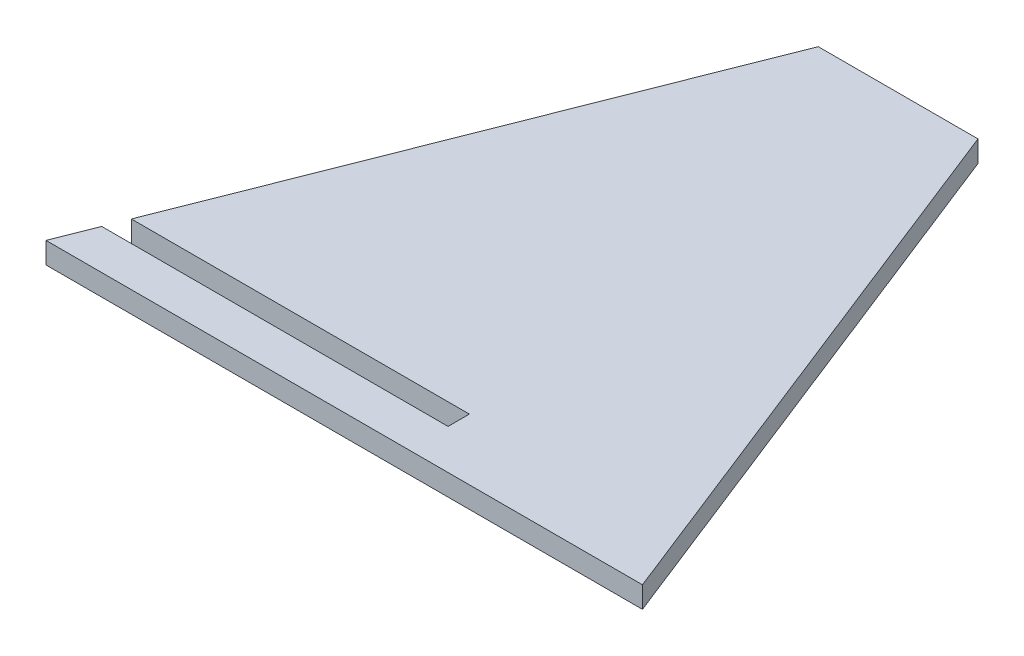
ISO-10303-21;
HEADER;
FILE_DESCRIPTION(('STEP AP214'),'2;1');
FILE_NAME('part.step','',(''),(''),'','','');
FILE_SCHEMA(('AUTOMOTIVE_DESIGN { 1 0 10303 214 1 1 1 1 }'));
ENDSEC;
DATA;
#1=APPLICATION_CONTEXT('core data for automotive mechanical design processes');
#2=APPLICATION_PROTOCOL_DEFINITION('international standard','automotive_design',2000,#1);
#3=PRODUCT_CONTEXT('',#1,'mechanical');
#4=PRODUCT('Part','Part','',(#3));
#5=PRODUCT_RELATED_PRODUCT_CATEGORY('part','',(#4));
#6=PRODUCT_DEFINITION_FORMATION('','',#4);
#7=PRODUCT_DEFINITION_CONTEXT('part definition',#1,'design');
#8=PRODUCT_DEFINITION('design','',#6,#7);
#9=PRODUCT_DEFINITION_SHAPE('','',#8);
#10=(LENGTH_UNIT() NAMED_UNIT(*) SI_UNIT(.MILLI.,.METRE.));
#11=(NAMED_UNIT(*) PLANE_ANGLE_UNIT() SI_UNIT($,.RADIAN.));
#12=(NAMED_UNIT(*) SI_UNIT($,.STERADIAN.) SOLID_ANGLE_UNIT());
#13=UNCERTAINTY_MEASURE_WITH_UNIT(LENGTH_MEASURE(1.E-05),#10,'distance_accuracy_value','');
#14=(GEOMETRIC_REPRESENTATION_CONTEXT(3) GLOBAL_UNCERTAINTY_ASSIGNED_CONTEXT((#13)) GLOBAL_UNIT_ASSIGNED_CONTEXT((#10,
#11,#12)) REPRESENTATION_CONTEXT('',''));
#15=CARTESIAN_POINT('',(0.,0.,0.));
#16=DIRECTION('',(0.,0.,1.));
#17=DIRECTION('',(1.,0.,0.));
#18=AXIS2_PLACEMENT_3D('',#15,#16,#17);
#19=CARTESIAN_POINT('',(-70.9901652571003,4.,0.));
#20=DIRECTION('',(0.930345938397084,0.,0.366683016934312));
#21=DIRECTION('',(0.366683016934313,0.,-0.930345938397083));
#22=AXIS2_PLACEMENT_3D('',#19,#20,#21);
#23=PLANE('',#22);
#24=DIRECTION('',(0.,-1.,0.));
#25=VECTOR('',#24,1.);
#26=CARTESIAN_POINT('',(-66.4575989065557,4.,-11.5000000000001));
#27=LINE('',#26,#25);
#28=CARTESIAN_POINT('',(-66.4575989065557,4.,-11.5000000000001));
#29=VERTEX_POINT('',#28);
#30=CARTESIAN_POINT('',(-66.4575989065557,0.,-11.5000000000001));
#31=VERTEX_POINT('',#30);
#32=EDGE_CURVE('E162',#29,#31,#27,.T.);
#33=ORIENTED_EDGE('',*,*,#32,.F.);
#34=DIRECTION('',(-0.366683016934313,0.,0.930345938397083));
#35=VECTOR('',#34,1.);
#36=CARTESIAN_POINT('',(-70.9901652571003,4.,0.));
#37=LINE('',#36,#35);
#38=CARTESIAN_POINT('',(-30.,4.,-104.));
#39=VERTEX_POINT('',#38);
#40=EDGE_CURVE('E155',#39,#29,#37,.T.);
#41=ORIENTED_EDGE('',*,*,#40,.F.);
#42=DIRECTION('',(0.,-1.,0.));
#43=VECTOR('',#42,1.);
#44=CARTESIAN_POINT('',(-30.,4.,-104.));
#45=LINE('',#44,#43);
#46=CARTESIAN_POINT('',(-30.,0.,-104.));
#47=VERTEX_POINT('',#46);
#48=EDGE_CURVE('E134',#39,#47,#45,.T.);
#49=ORIENTED_EDGE('',*,*,#48,.T.);
#50=DIRECTION('',(-0.366683016934313,0.,0.930345938397083));
#51=VECTOR('',#50,1.);
#52=CARTESIAN_POINT('',(-70.9901652571003,0.,0.));
#53=LINE('',#52,#51);
#54=EDGE_CURVE('E145',#47,#31,#53,.T.);
#55=ORIENTED_EDGE('',*,*,#54,.T.);
#56=EDGE_LOOP('',(#33,#41,#49,#55));
#57=FACE_BOUND('',#56,.T.);
#58=ADVANCED_FACE('F38',(#57),#23,.F.);
#59=CARTESIAN_POINT('',(0.,4.00000000000001,0.));
#60=DIRECTION('',(0.,-1.,0.));
#61=DIRECTION('',(0.,0.,-0.999999999999999));
#62=AXIS2_PLACEMENT_3D('',#59,#60,#61);
#63=PLANE('',#62);
#64=DIRECTION('',(-1.,0.,0.));
#65=VECTOR('',#64,1.);
#66=CARTESIAN_POINT('',(0.,4.00000000000001,-11.5000000000001));
#67=LINE('',#66,#65);
#68=CARTESIAN_POINT('',(-3.00000000000011,4.00000000000001,-11.5000000000001));
#69=VERTEX_POINT('',#68);
#70=EDGE_CURVE('E153',#69,#29,#67,.T.);
#71=ORIENTED_EDGE('',*,*,#70,.F.);
#72=DIRECTION('',(0.,0.,0.999999999999999));
#73=VECTOR('',#72,1.);
#74=CARTESIAN_POINT('',(-3.00000000000011,4.00000000000001,0.));
#75=LINE('',#74,#73);
#76=CARTESIAN_POINT('',(-3.00000000000011,4.00000000000001,-7.50000000000006));
#77=VERTEX_POINT('',#76);
#78=EDGE_CURVE('E130',#69,#77,#75,.T.);
#79=ORIENTED_EDGE('',*,*,#78,.T.);
#80=DIRECTION('',(-1.,0.,0.));
#81=VECTOR('',#80,1.);
#82=CARTESIAN_POINT('',(0.,4.00000000000001,-7.50000000000006));
#83=LINE('',#82,#81);
#84=CARTESIAN_POINT('',(-68.0341437241365,4.,-7.50000000000006));
#85=VERTEX_POINT('',#84);
#86=EDGE_CURVE('E117',#77,#85,#83,.T.);
#87=ORIENTED_EDGE('',*,*,#86,.T.);
#88=CARTESIAN_POINT('',(-70.9901652571003,4.,0.));
#89=VERTEX_POINT('',#88);
#90=EDGE_CURVE('E158',#85,#89,#37,.T.);
#91=ORIENTED_EDGE('',*,*,#90,.T.);
#92=DIRECTION('',(1.,0.,0.));
#93=VECTOR('',#92,1.);
#94=CARTESIAN_POINT('',(40.9999999999999,4.00000000000002,0.));
#95=LINE('',#94,#93);
#96=CARTESIAN_POINT('',(40.9999999999999,4.00000000000002,0.));
#97=VERTEX_POINT('',#96);
#98=EDGE_CURVE('E55',#89,#97,#95,.T.);
#99=ORIENTED_EDGE('',*,*,#98,.T.);
#100=DIRECTION('',(-0.366759162050394,0.,-0.93031592324978));
#101=VECTOR('',#100,1.);
#102=CARTESIAN_POINT('',(-2.22044604925031E-13,4.00000000000001,-104.));
#103=LINE('',#102,#101);
#104=CARTESIAN_POINT('',(-2.22044604925031E-13,4.00000000000001,-104.));
#105=VERTEX_POINT('',#104);
#106=EDGE_CURVE('E144',#97,#105,#103,.T.);
#107=ORIENTED_EDGE('',*,*,#106,.T.);
#108=DIRECTION('',(-1.,0.,0.));
#109=VECTOR('',#108,1.);
#110=CARTESIAN_POINT('',(-30.,4.,-104.));
#111=LINE('',#110,#109);
#112=EDGE_CURVE('E87',#105,#39,#111,.T.);
#113=ORIENTED_EDGE('',*,*,#112,.T.);
#114=ORIENTED_EDGE('',*,*,#40,.T.);
#115=EDGE_LOOP('',(#71,#79,#87,#91,#99,#107,#113,#114));
#116=FACE_BOUND('',#115,.T.);
#117=ADVANCED_FACE('F182',(#116),#63,.F.);
#118=CARTESIAN_POINT('',(0.,0.,0.));
#119=DIRECTION('',(0.,-1.,0.));
#120=DIRECTION('',(0.,0.,-0.999999999999999));
#121=AXIS2_PLACEMENT_3D('',#118,#119,#120);
#122=PLANE('',#121);
#123=DIRECTION('',(0.,0.,0.999999999999999));
#124=VECTOR('',#123,1.);
#125=CARTESIAN_POINT('',(-3.00000000000011,-2.77555756156289E-13,-11.5000000000001));
#126=LINE('',#125,#124);
#127=CARTESIAN_POINT('',(-3.00000000000011,-2.77555756156289E-13,-11.5000000000001));
#128=VERTEX_POINT('',#127);
#129=CARTESIAN_POINT('',(-3.00000000000011,-3.05311331771918E-13,-7.50000000000006));
#130=VERTEX_POINT('',#129);
#131=EDGE_CURVE('E124',#128,#130,#126,.T.);
#132=ORIENTED_EDGE('',*,*,#131,.F.);
#133=DIRECTION('',(-1.,0.,0.));
#134=VECTOR('',#133,1.);
#135=CARTESIAN_POINT('',(0.,0.,-11.5000000000001));
#136=LINE('',#135,#134);
#137=EDGE_CURVE('E11',#128,#31,#136,.T.);
#138=ORIENTED_EDGE('',*,*,#137,.T.);
#139=ORIENTED_EDGE('',*,*,#54,.F.);
#140=DIRECTION('',(-1.,0.,0.));
#141=VECTOR('',#140,1.);
#142=CARTESIAN_POINT('',(-30.,0.,-104.));
#143=LINE('',#142,#141);
#144=CARTESIAN_POINT('',(-2.22044604925031E-13,0.,-104.));
#145=VERTEX_POINT('',#144);
#146=EDGE_CURVE('E148',#145,#47,#143,.T.);
#147=ORIENTED_EDGE('',*,*,#146,.F.);
#148=DIRECTION('',(-0.366759162050394,0.,-0.93031592324978));
#149=VECTOR('',#148,1.);
#150=CARTESIAN_POINT('',(-2.22044604925031E-13,0.,-104.));
#151=LINE('',#150,#149);
#152=CARTESIAN_POINT('',(40.9999999999999,0.,0.));
#153=VERTEX_POINT('',#152);
#154=EDGE_CURVE('E150',#153,#145,#151,.T.);
#155=ORIENTED_EDGE('',*,*,#154,.F.);
#156=DIRECTION('',(1.,0.,0.));
#157=VECTOR('',#156,1.);
#158=CARTESIAN_POINT('',(40.9999999999999,0.,0.));
#159=LINE('',#158,#157);
#160=CARTESIAN_POINT('',(-70.9901652571003,0.,0.));
#161=VERTEX_POINT('',#160);
#162=EDGE_CURVE('E79',#161,#153,#159,.T.);
#163=ORIENTED_EDGE('',*,*,#162,.F.);
#164=CARTESIAN_POINT('',(-68.0341437241365,0.,-7.50000000000006));
#165=VERTEX_POINT('',#164);
#166=EDGE_CURVE('E73',#165,#161,#53,.T.);
#167=ORIENTED_EDGE('',*,*,#166,.F.);
#168=DIRECTION('',(-1.,0.,0.));
#169=VECTOR('',#168,1.);
#170=CARTESIAN_POINT('',(0.,0.,-7.50000000000006));
#171=LINE('',#170,#169);
#172=EDGE_CURVE('E47',#130,#165,#171,.T.);
#173=ORIENTED_EDGE('',*,*,#172,.F.);
#174=EDGE_LOOP('',(#132,#138,#139,#147,#155,#163,#167,#173));
#175=FACE_BOUND('',#174,.T.);
#176=ADVANCED_FACE('F132',(#175),#122,.T.);
#177=CARTESIAN_POINT('',(-2.22044604925031E-13,4.00000000000001,-104.));
#178=DIRECTION('',(-0.930315923249781,0.,0.366759162050394));
#179=DIRECTION('',(0.366759162050395,0.,0.93031592324978));
#180=AXIS2_PLACEMENT_3D('',#177,#178,#179);
#181=PLANE('',#180);
#182=ORIENTED_EDGE('',*,*,#154,.T.);
#183=DIRECTION('',(0.,-1.,0.));
#184=VECTOR('',#183,1.);
#185=CARTESIAN_POINT('',(-2.22044604925031E-13,4.00000000000001,-104.));
#186=LINE('',#185,#184);
#187=EDGE_CURVE('E133',#105,#145,#186,.T.);
#188=ORIENTED_EDGE('',*,*,#187,.F.);
#189=ORIENTED_EDGE('',*,*,#106,.F.);
#190=DIRECTION('',(0.,-1.,0.));
#191=VECTOR('',#190,1.);
#192=CARTESIAN_POINT('',(40.9999999999999,4.00000000000002,0.));
#193=LINE('',#192,#191);
#194=EDGE_CURVE('E141',#97,#153,#193,.T.);
#195=ORIENTED_EDGE('',*,*,#194,.T.);
#196=EDGE_LOOP('',(#182,#188,#189,#195));
#197=FACE_BOUND('',#196,.T.);
#198=ADVANCED_FACE('F40',(#197),#181,.F.);
#199=CARTESIAN_POINT('',(-30.,4.,-104.));
#200=DIRECTION('',(0.,0.,0.999999999999999));
#201=DIRECTION('',(1.,0.,0.));
#202=AXIS2_PLACEMENT_3D('',#199,#200,#201);
#203=PLANE('',#202);
#204=ORIENTED_EDGE('',*,*,#146,.T.);
#205=ORIENTED_EDGE('',*,*,#48,.F.);
#206=ORIENTED_EDGE('',*,*,#112,.F.);
#207=ORIENTED_EDGE('',*,*,#187,.T.);
#208=EDGE_LOOP('',(#204,#205,#206,#207));
#209=FACE_BOUND('',#208,.T.);
#210=ADVANCED_FACE('F175',(#209),#203,.F.);
#211=ORIENTED_EDGE('',*,*,#90,.F.);
#212=DIRECTION('',(0.,-1.,0.));
#213=VECTOR('',#212,1.);
#214=CARTESIAN_POINT('',(-68.0341437241365,4.,-7.50000000000006));
#215=LINE('',#214,#213);
#216=EDGE_CURVE('E129',#85,#165,#215,.T.);
#217=ORIENTED_EDGE('',*,*,#216,.T.);
#218=ORIENTED_EDGE('',*,*,#166,.T.);
#219=DIRECTION('',(0.,-1.,0.));
#220=VECTOR('',#219,1.);
#221=CARTESIAN_POINT('',(-70.9901652571003,4.,0.));
#222=LINE('',#221,#220);
#223=EDGE_CURVE('E139',#89,#161,#222,.T.);
#224=ORIENTED_EDGE('',*,*,#223,.F.);
#225=EDGE_LOOP('',(#211,#217,#218,#224));
#226=FACE_BOUND('',#225,.T.);
#227=ADVANCED_FACE('F181',(#226),#23,.F.);
#228=CARTESIAN_POINT('',(40.9999999999999,4.00000000000002,0.));
#229=DIRECTION('',(0.,0.,-0.999999999999999));
#230=DIRECTION('',(-1.,0.,0.));
#231=AXIS2_PLACEMENT_3D('',#228,#229,#230);
#232=PLANE('',#231);
#233=ORIENTED_EDGE('',*,*,#162,.T.);
#234=ORIENTED_EDGE('',*,*,#194,.F.);
#235=ORIENTED_EDGE('',*,*,#98,.F.);
#236=ORIENTED_EDGE('',*,*,#223,.T.);
#237=EDGE_LOOP('',(#233,#234,#235,#236));
#238=FACE_BOUND('',#237,.T.);
#239=ADVANCED_FACE('F179',(#238),#232,.F.);
#240=CARTESIAN_POINT('',(-27.0000000000001,-3.00000000000028,-11.5000000000001));
#241=DIRECTION('',(0.,0.,0.999999999999999));
#242=DIRECTION('',(1.,0.,0.));
#243=AXIS2_PLACEMENT_3D('',#240,#241,#242);
#244=PLANE('',#243);
#245=ORIENTED_EDGE('',*,*,#32,.T.);
#246=ORIENTED_EDGE('',*,*,#137,.F.);
#247=DIRECTION('',(0.,1.,0.));
#248=VECTOR('',#247,1.);
#249=CARTESIAN_POINT('',(-3.00000000000011,-3.05311331771918E-13,-11.5000000000001));
#250=LINE('',#249,#248);
#251=EDGE_CURVE('E121',#128,#69,#250,.T.);
#252=ORIENTED_EDGE('',*,*,#251,.T.);
#253=ORIENTED_EDGE('',*,*,#70,.T.);
#254=EDGE_LOOP('',(#245,#246,#252,#253));
#255=FACE_BOUND('',#254,.T.);
#256=ADVANCED_FACE('F169',(#255),#244,.T.);
#257=CARTESIAN_POINT('',(-27.0000000000001,-3.00000000000028,-7.50000000000006));
#258=DIRECTION('',(0.,0.,0.999999999999999));
#259=DIRECTION('',(1.,0.,0.));
#260=AXIS2_PLACEMENT_3D('',#257,#258,#259);
#261=PLANE('',#260);
#262=ORIENTED_EDGE('',*,*,#86,.F.);
#263=DIRECTION('',(0.,1.,0.));
#264=VECTOR('',#263,1.);
#265=CARTESIAN_POINT('',(-3.00000000000011,-3.05311331771918E-13,-7.50000000000006));
#266=LINE('',#265,#264);
#267=EDGE_CURVE('E112',#130,#77,#266,.T.);
#268=ORIENTED_EDGE('',*,*,#267,.F.);
#269=ORIENTED_EDGE('',*,*,#172,.T.);
#270=ORIENTED_EDGE('',*,*,#216,.F.);
#271=EDGE_LOOP('',(#262,#268,#269,#270));
#272=FACE_BOUND('',#271,.T.);
#273=ADVANCED_FACE('F114',(#272),#261,.F.);
#274=CARTESIAN_POINT('',(-3.00000000000011,-3.05311331771918E-13,-11.5000000000001));
#275=DIRECTION('',(1.,0.,0.));
#276=DIRECTION('',(0.,0.,-0.999999999999999));
#277=AXIS2_PLACEMENT_3D('',#274,#275,#276);
#278=PLANE('',#277);
#279=ORIENTED_EDGE('',*,*,#251,.F.);
#280=ORIENTED_EDGE('',*,*,#131,.T.);
#281=ORIENTED_EDGE('',*,*,#267,.T.);
#282=ORIENTED_EDGE('',*,*,#78,.F.);
#283=EDGE_LOOP('',(#279,#280,#281,#282));
#284=FACE_BOUND('',#283,.T.);
#285=ADVANCED_FACE('F125',(#284),#278,.F.);
#286=CLOSED_SHELL('',(#58,#117,#176,#198,#210,#227,#239,#256,#273,#285));
#287=MANIFOLD_SOLID_BREP('B2',#286);
#288=ADVANCED_BREP_SHAPE_REPRESENTATION('',(#18,#287),#14);
#289=SHAPE_DEFINITION_REPRESENTATION(#9,#288);
ENDSEC;
END-ISO-10303-21;
